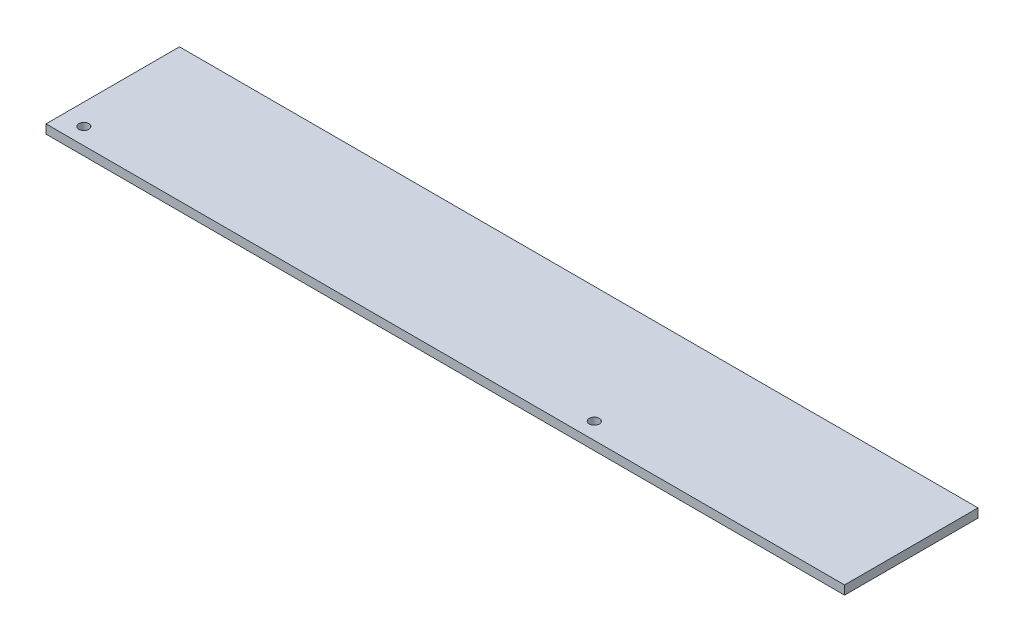
ISO-10303-21;
HEADER;
FILE_DESCRIPTION(('STEP AP214'),'2;1');
FILE_NAME('part.step','',(''),(''),'','','');
FILE_SCHEMA(('AUTOMOTIVE_DESIGN { 1 0 10303 214 1 1 1 1 }'));
ENDSEC;
DATA;
#1=APPLICATION_CONTEXT('core data for automotive mechanical design processes');
#2=APPLICATION_PROTOCOL_DEFINITION('international standard','automotive_design',2000,#1);
#3=PRODUCT_CONTEXT('',#1,'mechanical');
#4=PRODUCT('Part','Part','',(#3));
#5=PRODUCT_RELATED_PRODUCT_CATEGORY('part','',(#4));
#6=PRODUCT_DEFINITION_FORMATION('','',#4);
#7=PRODUCT_DEFINITION_CONTEXT('part definition',#1,'design');
#8=PRODUCT_DEFINITION('design','',#6,#7);
#9=PRODUCT_DEFINITION_SHAPE('','',#8);
#10=(LENGTH_UNIT() NAMED_UNIT(*) SI_UNIT(.MILLI.,.METRE.));
#11=(NAMED_UNIT(*) PLANE_ANGLE_UNIT() SI_UNIT($,.RADIAN.));
#12=(NAMED_UNIT(*) SI_UNIT($,.STERADIAN.) SOLID_ANGLE_UNIT());
#13=UNCERTAINTY_MEASURE_WITH_UNIT(LENGTH_MEASURE(1.E-05),#10,'distance_accuracy_value','');
#14=(GEOMETRIC_REPRESENTATION_CONTEXT(3) GLOBAL_UNCERTAINTY_ASSIGNED_CONTEXT((#13)) GLOBAL_UNIT_ASSIGNED_CONTEXT((#10,
#11,#12)) REPRESENTATION_CONTEXT('',''));
#15=CARTESIAN_POINT('',(0.,0.,0.));
#16=DIRECTION('',(0.,0.,1.));
#17=DIRECTION('',(1.,0.,0.));
#18=AXIS2_PLACEMENT_3D('',#15,#16,#17);
#19=CARTESIAN_POINT('',(359.,-2.,-30.));
#20=DIRECTION('',(0.,0.,1.));
#21=DIRECTION('',(1.,0.,0.));
#22=AXIS2_PLACEMENT_3D('',#19,#20,#21);
#23=PLANE('',#22);
#24=DIRECTION('',(0.,1.,0.));
#25=VECTOR('',#24,1.);
#26=CARTESIAN_POINT('',(0.,-2.,-30.));
#27=LINE('',#26,#25);
#28=CARTESIAN_POINT('',(0.,-2.,-30.));
#29=VERTEX_POINT('',#28);
#30=CARTESIAN_POINT('',(0.,2.,-30.));
#31=VERTEX_POINT('',#30);
#32=EDGE_CURVE('E98',#29,#31,#27,.T.);
#33=ORIENTED_EDGE('',*,*,#32,.T.);
#34=DIRECTION('',(-1.,0.,0.));
#35=VECTOR('',#34,1.);
#36=CARTESIAN_POINT('',(359.,2.,-30.));
#37=LINE('',#36,#35);
#38=CARTESIAN_POINT('',(359.,2.,-30.));
#39=VERTEX_POINT('',#38);
#40=EDGE_CURVE('E11',#39,#31,#37,.T.);
#41=ORIENTED_EDGE('',*,*,#40,.F.);
#42=DIRECTION('',(0.,1.,0.));
#43=VECTOR('',#42,1.);
#44=CARTESIAN_POINT('',(359.,-2.,-30.));
#45=LINE('',#44,#43);
#46=CARTESIAN_POINT('',(359.,-2.,-30.));
#47=VERTEX_POINT('',#46);
#48=EDGE_CURVE('E86',#47,#39,#45,.T.);
#49=ORIENTED_EDGE('',*,*,#48,.F.);
#50=DIRECTION('',(-1.,0.,0.));
#51=VECTOR('',#50,1.);
#52=CARTESIAN_POINT('',(359.,-2.,-30.));
#53=LINE('',#52,#51);
#54=EDGE_CURVE('E94',#47,#29,#53,.T.);
#55=ORIENTED_EDGE('',*,*,#54,.T.);
#56=EDGE_LOOP('',(#33,#41,#49,#55));
#57=FACE_BOUND('',#56,.T.);
#58=ADVANCED_FACE('F35',(#57),#23,.F.);
#59=CARTESIAN_POINT('',(359.,2.,30.));
#60=DIRECTION('',(0.,-1.,0.));
#61=DIRECTION('',(0.,0.,-1.));
#62=AXIS2_PLACEMENT_3D('',#59,#60,#61);
#63=PLANE('',#62);
#64=CARTESIAN_POINT('',(9.5,2.,22.5));
#65=DIRECTION('',(0.,1.,0.));
#66=DIRECTION('',(0.,0.,1.));
#67=AXIS2_PLACEMENT_3D('',#64,#65,#66);
#68=CIRCLE('',#67,2.25);
#69=CARTESIAN_POINT('',(9.5,2.,24.75));
#70=VERTEX_POINT('',#69);
#71=EDGE_CURVE('E118',#70,#70,#68,.T.);
#72=ORIENTED_EDGE('',*,*,#71,.F.);
#73=EDGE_LOOP('',(#72));
#74=FACE_BOUND('',#73,.T.);
#75=CARTESIAN_POINT('',(239.,2.,22.5));
#76=DIRECTION('',(0.,1.,0.));
#77=DIRECTION('',(0.,0.,1.));
#78=AXIS2_PLACEMENT_3D('',#75,#76,#77);
#79=CIRCLE('',#78,2.24999999999995);
#80=CARTESIAN_POINT('',(239.,2.,24.75));
#81=VERTEX_POINT('',#80);
#82=EDGE_CURVE('E112',#81,#81,#79,.T.);
#83=ORIENTED_EDGE('',*,*,#82,.F.);
#84=EDGE_LOOP('',(#83));
#85=FACE_BOUND('',#84,.T.);
#86=DIRECTION('',(0.,0.,1.));
#87=VECTOR('',#86,1.);
#88=CARTESIAN_POINT('',(0.,2.,30.));
#89=LINE('',#88,#87);
#90=CARTESIAN_POINT('',(0.,2.,30.));
#91=VERTEX_POINT('',#90);
#92=EDGE_CURVE('E90',#31,#91,#89,.T.);
#93=ORIENTED_EDGE('',*,*,#92,.T.);
#94=DIRECTION('',(-1.,0.,0.));
#95=VECTOR('',#94,1.);
#96=CARTESIAN_POINT('',(359.,2.,30.));
#97=LINE('',#96,#95);
#98=CARTESIAN_POINT('',(359.,2.,30.));
#99=VERTEX_POINT('',#98);
#100=EDGE_CURVE('E43',#99,#91,#97,.T.);
#101=ORIENTED_EDGE('',*,*,#100,.F.);
#102=DIRECTION('',(0.,0.,1.));
#103=VECTOR('',#102,1.);
#104=CARTESIAN_POINT('',(359.,2.,30.));
#105=LINE('',#104,#103);
#106=EDGE_CURVE('E81',#39,#99,#105,.T.);
#107=ORIENTED_EDGE('',*,*,#106,.F.);
#108=ORIENTED_EDGE('',*,*,#40,.T.);
#109=EDGE_LOOP('',(#93,#101,#107,#108));
#110=FACE_BOUND('',#109,.T.);
#111=ADVANCED_FACE('F89',(#74,#85,#110),#63,.F.);
#112=CARTESIAN_POINT('',(359.,-2.,30.));
#113=DIRECTION('',(0.,0.,-1.));
#114=DIRECTION('',(-1.,0.,0.));
#115=AXIS2_PLACEMENT_3D('',#112,#113,#114);
#116=PLANE('',#115);
#117=DIRECTION('',(0.,-1.,0.));
#118=VECTOR('',#117,1.);
#119=CARTESIAN_POINT('',(0.,-2.,30.));
#120=LINE('',#119,#118);
#121=CARTESIAN_POINT('',(0.,-2.,30.));
#122=VERTEX_POINT('',#121);
#123=EDGE_CURVE('E68',#91,#122,#120,.T.);
#124=ORIENTED_EDGE('',*,*,#123,.T.);
#125=DIRECTION('',(-1.,0.,0.));
#126=VECTOR('',#125,1.);
#127=CARTESIAN_POINT('',(359.,-2.,30.));
#128=LINE('',#127,#126);
#129=CARTESIAN_POINT('',(359.,-2.,30.));
#130=VERTEX_POINT('',#129);
#131=EDGE_CURVE('E91',#130,#122,#128,.T.);
#132=ORIENTED_EDGE('',*,*,#131,.F.);
#133=DIRECTION('',(0.,-1.,0.));
#134=VECTOR('',#133,1.);
#135=CARTESIAN_POINT('',(359.,-2.,30.));
#136=LINE('',#135,#134);
#137=EDGE_CURVE('E84',#99,#130,#136,.T.);
#138=ORIENTED_EDGE('',*,*,#137,.F.);
#139=ORIENTED_EDGE('',*,*,#100,.T.);
#140=EDGE_LOOP('',(#124,#132,#138,#139));
#141=FACE_BOUND('',#140,.T.);
#142=ADVANCED_FACE('F92',(#141),#116,.F.);
#143=CARTESIAN_POINT('',(359.,-2.,30.));
#144=DIRECTION('',(0.,1.,0.));
#145=DIRECTION('',(0.,0.,1.));
#146=AXIS2_PLACEMENT_3D('',#143,#144,#145);
#147=PLANE('',#146);
#148=CARTESIAN_POINT('',(9.5,-2.,22.5));
#149=DIRECTION('',(0.,1.,0.));
#150=DIRECTION('',(0.,0.,1.));
#151=AXIS2_PLACEMENT_3D('',#148,#149,#150);
#152=CIRCLE('',#151,2.25);
#153=CARTESIAN_POINT('',(9.5,-2.,24.75));
#154=VERTEX_POINT('',#153);
#155=EDGE_CURVE('E101',#154,#154,#152,.T.);
#156=ORIENTED_EDGE('',*,*,#155,.T.);
#157=EDGE_LOOP('',(#156));
#158=FACE_BOUND('',#157,.T.);
#159=CARTESIAN_POINT('',(239.,-2.,22.5));
#160=DIRECTION('',(0.,1.,0.));
#161=DIRECTION('',(0.,0.,1.));
#162=AXIS2_PLACEMENT_3D('',#159,#160,#161);
#163=CIRCLE('',#162,2.24999999999995);
#164=CARTESIAN_POINT('',(239.,-2.,24.75));
#165=VERTEX_POINT('',#164);
#166=EDGE_CURVE('E115',#165,#165,#163,.T.);
#167=ORIENTED_EDGE('',*,*,#166,.T.);
#168=EDGE_LOOP('',(#167));
#169=FACE_BOUND('',#168,.T.);
#170=DIRECTION('',(0.,0.,-1.));
#171=VECTOR('',#170,1.);
#172=CARTESIAN_POINT('',(0.,-2.,30.));
#173=LINE('',#172,#171);
#174=EDGE_CURVE('E74',#122,#29,#173,.T.);
#175=ORIENTED_EDGE('',*,*,#174,.T.);
#176=ORIENTED_EDGE('',*,*,#54,.F.);
#177=DIRECTION('',(0.,0.,-1.));
#178=VECTOR('',#177,1.);
#179=CARTESIAN_POINT('',(359.,-2.,30.));
#180=LINE('',#179,#178);
#181=EDGE_CURVE('E51',#130,#47,#180,.T.);
#182=ORIENTED_EDGE('',*,*,#181,.F.);
#183=ORIENTED_EDGE('',*,*,#131,.T.);
#184=EDGE_LOOP('',(#175,#176,#182,#183));
#185=FACE_BOUND('',#184,.T.);
#186=ADVANCED_FACE('F106',(#158,#169,#185),#147,.F.);
#187=CARTESIAN_POINT('',(359.,0.,0.));
#188=DIRECTION('',(-1.,0.,0.));
#189=DIRECTION('',(0.,0.,1.));
#190=AXIS2_PLACEMENT_3D('',#187,#188,#189);
#191=PLANE('',#190);
#192=ORIENTED_EDGE('',*,*,#48,.T.);
#193=ORIENTED_EDGE('',*,*,#106,.T.);
#194=ORIENTED_EDGE('',*,*,#137,.T.);
#195=ORIENTED_EDGE('',*,*,#181,.T.);
#196=EDGE_LOOP('',(#192,#193,#194,#195));
#197=FACE_BOUND('',#196,.T.);
#198=ADVANCED_FACE('F82',(#197),#191,.F.);
#199=CARTESIAN_POINT('',(0.,0.,0.));
#200=DIRECTION('',(-1.,0.,0.));
#201=DIRECTION('',(0.,0.,1.));
#202=AXIS2_PLACEMENT_3D('',#199,#200,#201);
#203=PLANE('',#202);
#204=ORIENTED_EDGE('',*,*,#32,.F.);
#205=ORIENTED_EDGE('',*,*,#174,.F.);
#206=ORIENTED_EDGE('',*,*,#123,.F.);
#207=ORIENTED_EDGE('',*,*,#92,.F.);
#208=EDGE_LOOP('',(#204,#205,#206,#207));
#209=FACE_BOUND('',#208,.T.);
#210=ADVANCED_FACE('F109',(#209),#203,.T.);
#211=CARTESIAN_POINT('',(239.,-2.,22.5));
#212=DIRECTION('',(0.,1.,0.));
#213=DIRECTION('',(0.,0.,1.));
#214=AXIS2_PLACEMENT_3D('',#211,#212,#213);
#215=CYLINDRICAL_SURFACE('',#214,2.24999999999995);
#216=ORIENTED_EDGE('',*,*,#166,.F.);
#217=EDGE_LOOP('',(#216));
#218=FACE_BOUND('',#217,.T.);
#219=ORIENTED_EDGE('',*,*,#82,.T.);
#220=EDGE_LOOP('',(#219));
#221=FACE_BOUND('',#220,.T.);
#222=ADVANCED_FACE('F129',(#218,#221),#215,.F.);
#223=CARTESIAN_POINT('',(9.5,-2.,22.5));
#224=DIRECTION('',(0.,1.,0.));
#225=DIRECTION('',(0.,0.,1.));
#226=AXIS2_PLACEMENT_3D('',#223,#224,#225);
#227=CYLINDRICAL_SURFACE('',#226,2.25);
#228=ORIENTED_EDGE('',*,*,#155,.F.);
#229=EDGE_LOOP('',(#228));
#230=FACE_BOUND('',#229,.T.);
#231=ORIENTED_EDGE('',*,*,#71,.T.);
#232=EDGE_LOOP('',(#231));
#233=FACE_BOUND('',#232,.T.);
#234=ADVANCED_FACE('F126',(#230,#233),#227,.F.);
#235=CLOSED_SHELL('',(#58,#111,#142,#186,#198,#210,#222,#234));
#236=MANIFOLD_SOLID_BREP('B2',#235);
#237=ADVANCED_BREP_SHAPE_REPRESENTATION('',(#18,#236),#14);
#238=SHAPE_DEFINITION_REPRESENTATION(#9,#237);
ENDSEC;
END-ISO-10303-21;
